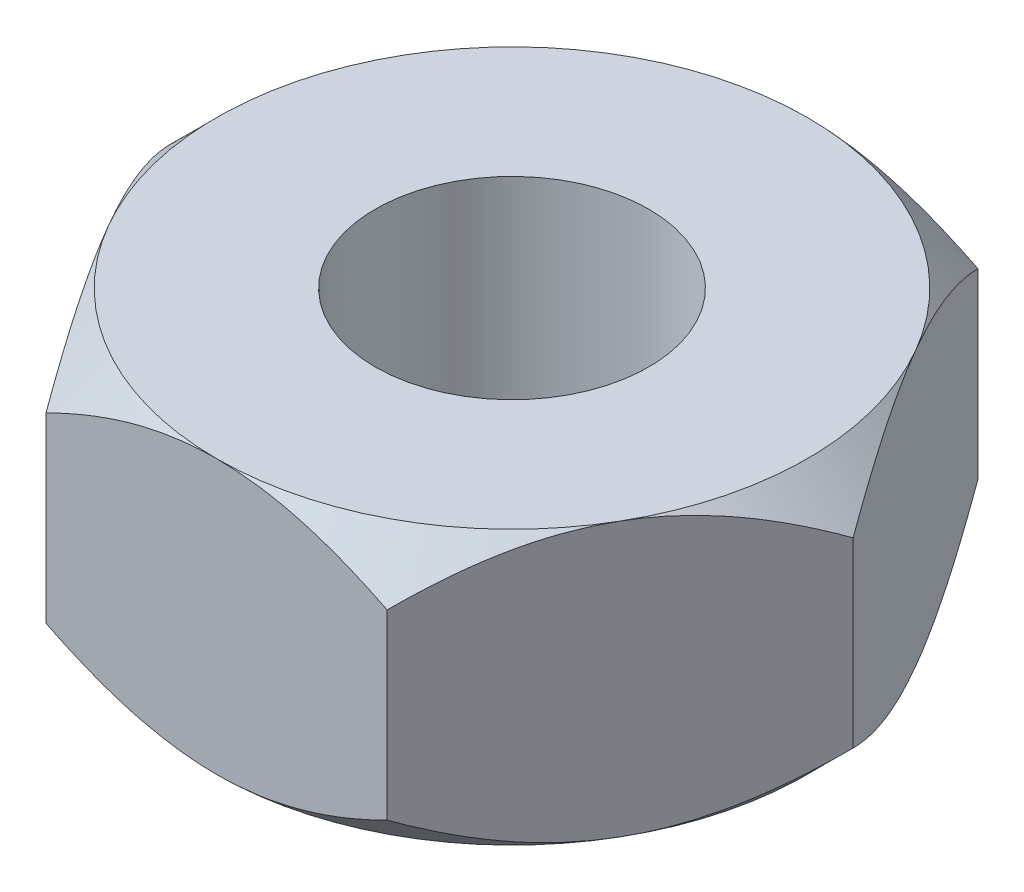
ISO-10303-21;
HEADER;
FILE_DESCRIPTION(('STEP AP214'),'2;1');
FILE_NAME('part.step','',(''),(''),'','','');
FILE_SCHEMA(('AUTOMOTIVE_DESIGN { 1 0 10303 214 1 1 1 1 }'));
ENDSEC;
DATA;
#1=APPLICATION_CONTEXT('core data for automotive mechanical design processes');
#2=APPLICATION_PROTOCOL_DEFINITION('international standard','automotive_design',2000,#1);
#3=PRODUCT_CONTEXT('',#1,'mechanical');
#4=PRODUCT('Part','Part','',(#3));
#5=PRODUCT_RELATED_PRODUCT_CATEGORY('part','',(#4));
#6=PRODUCT_DEFINITION_FORMATION('','',#4);
#7=PRODUCT_DEFINITION_CONTEXT('part definition',#1,'design');
#8=PRODUCT_DEFINITION('design','',#6,#7);
#9=PRODUCT_DEFINITION_SHAPE('','',#8);
#10=(LENGTH_UNIT() NAMED_UNIT(*) SI_UNIT(.MILLI.,.METRE.));
#11=(NAMED_UNIT(*) PLANE_ANGLE_UNIT() SI_UNIT($,.RADIAN.));
#12=(NAMED_UNIT(*) SI_UNIT($,.STERADIAN.) SOLID_ANGLE_UNIT());
#13=UNCERTAINTY_MEASURE_WITH_UNIT(LENGTH_MEASURE(1.E-05),#10,'distance_accuracy_value','');
#14=(GEOMETRIC_REPRESENTATION_CONTEXT(3) GLOBAL_UNCERTAINTY_ASSIGNED_CONTEXT((#13)) GLOBAL_UNIT_ASSIGNED_CONTEXT((#10,
#11,#12)) REPRESENTATION_CONTEXT('',''));
#15=CARTESIAN_POINT('',(0.,0.,0.));
#16=DIRECTION('',(0.,0.,1.));
#17=DIRECTION('',(1.,0.,0.));
#18=AXIS2_PLACEMENT_3D('',#15,#16,#17);
#19=CARTESIAN_POINT('',(0.,1.25,0.));
#20=DIRECTION('',(0.,1.,0.));
#21=DIRECTION('',(0.,0.,1.));
#22=AXIS2_PLACEMENT_3D('',#19,#20,#21);
#23=PLANE('',#22);
#24=CARTESIAN_POINT('',(0.,1.25,0.));
#25=DIRECTION('',(0.,1.,0.));
#26=DIRECTION('',(0.,0.,1.));
#27=AXIS2_PLACEMENT_3D('',#24,#25,#26);
#28=CIRCLE('',#27,1.24999999999999);
#29=CARTESIAN_POINT('',(0.,1.25,1.24999999999999));
#30=VERTEX_POINT('',#29);
#31=EDGE_CURVE('E305',#30,#30,#28,.T.);
#32=ORIENTED_EDGE('',*,*,#31,.F.);
#33=EDGE_LOOP('',(#32));
#34=FACE_BOUND('',#33,.T.);
#35=CARTESIAN_POINT('',(0.,1.25,0.));
#36=DIRECTION('',(0.,1.,0.));
#37=DIRECTION('',(0.,0.,1.));
#38=AXIS2_PLACEMENT_3D('',#35,#36,#37);
#39=CIRCLE('',#38,2.70000000000002);
#40=CARTESIAN_POINT('',(0.,1.25,2.70000000000002));
#41=VERTEX_POINT('',#40);
#42=CARTESIAN_POINT('',(-2.338268590218,1.25,1.35000000000001));
#43=VERTEX_POINT('',#42);
#44=EDGE_CURVE('E12',#41,#43,#39,.F.);
#45=ORIENTED_EDGE('',*,*,#44,.F.);
#46=CARTESIAN_POINT('',(2.338268590218,1.25,1.35000000000001));
#47=VERTEX_POINT('',#46);
#48=EDGE_CURVE('E48',#47,#41,#39,.F.);
#49=ORIENTED_EDGE('',*,*,#48,.F.);
#50=CARTESIAN_POINT('',(2.338268590218,1.25,-1.35000000000001));
#51=VERTEX_POINT('',#50);
#52=EDGE_CURVE('E158',#51,#47,#39,.F.);
#53=ORIENTED_EDGE('',*,*,#52,.F.);
#54=CARTESIAN_POINT('',(0.,1.25,0.));
#55=DIRECTION('',(0.,-1.,0.));
#56=DIRECTION('',(0.,0.,-1.));
#57=AXIS2_PLACEMENT_3D('',#54,#55,#56);
#58=CIRCLE('',#57,2.70000000000002);
#59=CARTESIAN_POINT('',(0.,1.25,-2.70000000000002));
#60=VERTEX_POINT('',#59);
#61=EDGE_CURVE('E146',#60,#51,#58,.T.);
#62=ORIENTED_EDGE('',*,*,#61,.F.);
#63=CARTESIAN_POINT('',(-2.338268590218,1.25,-1.35000000000001));
#64=VERTEX_POINT('',#63);
#65=EDGE_CURVE('E420',#64,#60,#39,.F.);
#66=ORIENTED_EDGE('',*,*,#65,.F.);
#67=EDGE_CURVE('E54',#43,#64,#39,.F.);
#68=ORIENTED_EDGE('',*,*,#67,.F.);
#69=EDGE_LOOP('',(#45,#49,#53,#62,#66,#68));
#70=FACE_BOUND('',#69,.T.);
#71=ADVANCED_FACE('F43',(#34,#70),#23,.T.);
#72=CARTESIAN_POINT('',(1.55884572681198,1.25,2.70000000000001));
#73=DIRECTION('',(-0.866025403784438,0.,-0.500000000000001));
#74=DIRECTION('',(-0.500000000000001,0.,0.866025403784438));
#75=AXIS2_PLACEMENT_3D('',#72,#73,#74);
#76=PLANE('',#75);
#77=DIRECTION('',(0.,-1.,0.));
#78=VECTOR('',#77,1.);
#79=CARTESIAN_POINT('',(3.11769145362398,1.25,0.));
#80=LINE('',#79,#78);
#81=CARTESIAN_POINT('',(3.11769145362398,0.832308546376041,0.));
#82=VERTEX_POINT('',#81);
#83=CARTESIAN_POINT('',(3.11769145362398,-0.832308546376041,0.));
#84=VERTEX_POINT('',#83);
#85=EDGE_CURVE('E329',#82,#84,#80,.T.);
#86=ORIENTED_EDGE('',*,*,#85,.F.);
#87=CARTESIAN_POINT('',(3.11780692367782,0.832193069907437,-0.000199999999996531));
#88=CARTESIAN_POINT('',(3.06422167379383,0.885732794827783,0.0926123753353544));
#89=CARTESIAN_POINT('',(3.009740407035,0.93612806527719,0.186976697422359));
#90=CARTESIAN_POINT('',(2.89864710495835,1.02840062434018,0.379395940999699));
#91=CARTESIAN_POINT('',(2.84202450431693,1.07022657249699,0.477469162167336));
#92=CARTESIAN_POINT('',(2.72784773232675,1.14187524757681,0.675229132298521));
#93=CARTESIAN_POINT('',(2.67032263900893,1.17187806135873,0.774865516635131));
#94=CARTESIAN_POINT('',(2.5540060491414,1.21810362683617,0.976331760048835));
#95=CARTESIAN_POINT('',(2.49521810592332,1.23436088475358,1.07815546457503));
#96=CARTESIAN_POINT('',(2.3939001211297,1.24902914006629,1.25364336195808));
#97=CARTESIAN_POINT('',(2.35150097221465,1.25120050888209,1.32708084207662));
#98=CARTESIAN_POINT('',(2.26677198310487,1.24754233330539,1.47383575608871));
#99=CARTESIAN_POINT('',(2.22444217241577,1.24170998398709,1.54715313887699));
#100=CARTESIAN_POINT('',(2.14018224558464,1.22237626945354,1.69309561319055));
#101=CARTESIAN_POINT('',(2.09825262999166,1.2088663254669,1.76571983773943));
#102=CARTESIAN_POINT('',(2.01511846407659,1.17491901553749,1.90971243694919));
#103=CARTESIAN_POINT('',(1.97391385842353,1.15448218067128,1.98108090744612));
#104=CARTESIAN_POINT('',(1.86837302526163,1.09381204154214,2.16388299275569));
#105=CARTESIAN_POINT('',(1.80469114916652,1.04900591768386,2.27418323767372));
#106=CARTESIAN_POINT('',(1.71105248224891,0.973367210017474,2.43637016632804));
#107=CARTESIAN_POINT('',(1.68019435228959,0.946791274382121,2.48981801524414));
#108=CARTESIAN_POINT('',(1.61904967325436,0.89121683212296,2.59572370594566));
#109=CARTESIAN_POINT('',(1.58876278712705,0.862219812555685,2.64818213152121));
#110=CARTESIAN_POINT('',(1.55873025675814,0.832193069907433,2.70020000000001));
#111=B_SPLINE_CURVE_WITH_KNOTS('',3,(#87,#88,#89,#90,#91,#92,#93,#94,#95,#96,#97,#98,#99,#100,
#101,#102,#103,#104,#105,#106,#107,#108,#109,#110),.UNSPECIFIED.,.F.,.F.,(4,2,2,2,2,2,2,2,2,2,2,
4),(0.,0.359648673878966,0.721392825422786,1.07739169570524,1.43249420646205,1.68661231167063,
1.94081949603894,2.19531128585872,2.44978356850446,2.85398095255913,3.05553160695458,
3.2569593647654),.UNSPECIFIED.);
#112=EDGE_CURVE('E414',#82,#47,#111,.T.);
#113=ORIENTED_EDGE('',*,*,#112,.T.);
#114=CARTESIAN_POINT('',(1.55884572681198,0.832308546376036,2.70000000000001));
#115=VERTEX_POINT('',#114);
#116=EDGE_CURVE('E153',#47,#115,#111,.T.);
#117=ORIENTED_EDGE('',*,*,#116,.T.);
#118=DIRECTION('',(0.,-1.,0.));
#119=VECTOR('',#118,1.);
#120=CARTESIAN_POINT('',(1.55884572681198,1.25,2.70000000000001));
#121=LINE('',#120,#119);
#122=CARTESIAN_POINT('',(1.55884572681198,-0.832308546376036,2.70000000000001));
#123=VERTEX_POINT('',#122);
#124=EDGE_CURVE('E164',#115,#123,#121,.T.);
#125=ORIENTED_EDGE('',*,*,#124,.T.);
#126=CARTESIAN_POINT('',(3.11780692367782,-0.832193069907437,-0.000199999999996531));
#127=CARTESIAN_POINT('',(3.06422167379383,-0.885732794827783,0.0926123753353544));
#128=CARTESIAN_POINT('',(3.009740407035,-0.93612806527719,0.186976697422359));
#129=CARTESIAN_POINT('',(2.89864710495835,-1.02840062434018,0.379395940999699));
#130=CARTESIAN_POINT('',(2.84202450431693,-1.07022657249699,0.477469162167336));
#131=CARTESIAN_POINT('',(2.72784773232675,-1.14187524757681,0.675229132298521));
#132=CARTESIAN_POINT('',(2.67032263900893,-1.17187806135873,0.774865516635131));
#133=CARTESIAN_POINT('',(2.5540060491414,-1.21810362683617,0.976331760048835));
#134=CARTESIAN_POINT('',(2.49521810592332,-1.23436088475358,1.07815546457503));
#135=CARTESIAN_POINT('',(2.3939001211297,-1.24902914006629,1.25364336195808));
#136=CARTESIAN_POINT('',(2.35150097221465,-1.25120050888209,1.32708084207662));
#137=CARTESIAN_POINT('',(2.26677198310487,-1.24754233330539,1.47383575608871));
#138=CARTESIAN_POINT('',(2.22444217241577,-1.24170998398709,1.54715313887699));
#139=CARTESIAN_POINT('',(2.14018224558464,-1.22237626945354,1.69309561319055));
#140=CARTESIAN_POINT('',(2.09825262999166,-1.2088663254669,1.76571983773943));
#141=CARTESIAN_POINT('',(2.01511846407659,-1.17491901553749,1.90971243694919));
#142=CARTESIAN_POINT('',(1.97391385842353,-1.15448218067128,1.98108090744612));
#143=CARTESIAN_POINT('',(1.86837302526163,-1.09381204154214,2.16388299275569));
#144=CARTESIAN_POINT('',(1.80469114916652,-1.04900591768386,2.27418323767372));
#145=CARTESIAN_POINT('',(1.71105248224891,-0.973367210017474,2.43637016632804));
#146=CARTESIAN_POINT('',(1.68019435228959,-0.946791274382121,2.48981801524414));
#147=CARTESIAN_POINT('',(1.61904967325436,-0.89121683212296,2.59572370594566));
#148=CARTESIAN_POINT('',(1.58876278712705,-0.862219812555685,2.64818213152121));
#149=CARTESIAN_POINT('',(1.55873025675814,-0.832193069907433,2.70020000000001));
#150=B_SPLINE_CURVE_WITH_KNOTS('',3,(#126,#127,#128,#129,#130,#131,#132,#133,#134,#135,#136,
#137,#138,#139,#140,#141,#142,#143,#144,#145,#146,#147,#148,#149),.UNSPECIFIED.,.F.,.F.,(4,2,2,
2,2,2,2,2,2,2,2,4),(0.,0.359648673878966,0.721392825422786,1.07739169570524,1.43249420646205,
1.68661231167063,1.94081949603894,2.19531128585872,2.44978356850446,2.85398095255913,
3.05553160695458,3.2569593647654),.UNSPECIFIED.);
#151=CARTESIAN_POINT('',(2.338268590218,-1.25,1.35000000000001));
#152=VERTEX_POINT('',#151);
#153=EDGE_CURVE('E235',#152,#123,#150,.T.);
#154=ORIENTED_EDGE('',*,*,#153,.F.);
#155=EDGE_CURVE('E379',#84,#152,#150,.T.);
#156=ORIENTED_EDGE('',*,*,#155,.F.);
#157=EDGE_LOOP('',(#86,#113,#117,#125,#154,#156));
#158=FACE_BOUND('',#157,.T.);
#159=ADVANCED_FACE('F45',(#158),#76,.F.);
#160=CARTESIAN_POINT('',(3.11769145362398,1.25,0.));
#161=DIRECTION('',(-0.866025403784438,0.,0.5));
#162=DIRECTION('',(0.5,0.,0.866025403784438));
#163=AXIS2_PLACEMENT_3D('',#160,#161,#162);
#164=PLANE('',#163);
#165=DIRECTION('',(0.,-1.,0.));
#166=VECTOR('',#165,1.);
#167=CARTESIAN_POINT('',(1.55884572681197,1.25,-2.70000000000002));
#168=LINE('',#167,#166);
#169=CARTESIAN_POINT('',(1.55884572681197,0.832308546376031,-2.70000000000002));
#170=VERTEX_POINT('',#169);
#171=CARTESIAN_POINT('',(1.55884572681197,-0.832308546376031,-2.70000000000002));
#172=VERTEX_POINT('',#171);
#173=EDGE_CURVE('E326',#170,#172,#168,.T.);
#174=ORIENTED_EDGE('',*,*,#173,.F.);
#175=CARTESIAN_POINT('',(1.55873025675814,0.832193069907427,-2.70020000000002));
#176=CARTESIAN_POINT('',(1.61231550664213,0.885732794827773,-2.60738762466467));
#177=CARTESIAN_POINT('',(1.66679677340096,0.936128065277182,-2.51302330257766));
#178=CARTESIAN_POINT('',(1.7778900754776,1.02840062434017,-2.32060405900032));
#179=CARTESIAN_POINT('',(1.83451267611903,1.07022657249699,-2.22253083783268));
#180=CARTESIAN_POINT('',(1.94868944810921,1.14187524757681,-2.0247708677015));
#181=CARTESIAN_POINT('',(2.00621454142703,1.17187806135873,-1.92513448336488));
#182=CARTESIAN_POINT('',(2.12253113129456,1.21810362683617,-1.72366823995118));
#183=CARTESIAN_POINT('',(2.18131907451264,1.23436088475358,-1.62184453542498));
#184=CARTESIAN_POINT('',(2.28263705930627,1.2490291400663,-1.44635663804193));
#185=CARTESIAN_POINT('',(2.32503620822131,1.2512005088821,-1.37291915792339));
#186=CARTESIAN_POINT('',(2.4097651973311,1.24754233330539,-1.2261642439113));
#187=CARTESIAN_POINT('',(2.45209500802019,1.24170998398709,-1.15284686112302));
#188=CARTESIAN_POINT('',(2.53635493485132,1.22237626945354,-1.00690438680946));
#189=CARTESIAN_POINT('',(2.57828455044431,1.2088663254669,-0.934280162260579));
#190=CARTESIAN_POINT('',(2.66141871635937,1.17491901553749,-0.790287563050821));
#191=CARTESIAN_POINT('',(2.70262332201243,1.15448218067128,-0.718919092553885));
#192=CARTESIAN_POINT('',(2.80816415517433,1.09381204154214,-0.53611700724432));
#193=CARTESIAN_POINT('',(2.87184603126944,1.04900591768386,-0.425816762326288));
#194=CARTESIAN_POINT('',(2.96548469818705,0.973367210017478,-0.263629833671965));
#195=CARTESIAN_POINT('',(2.99634282814637,0.946791274382125,-0.210181984755868));
#196=CARTESIAN_POINT('',(3.05748750718161,0.891216832122965,-0.104276294054347));
#197=CARTESIAN_POINT('',(3.08777439330891,0.862219812555689,-0.051817868478796));
#198=CARTESIAN_POINT('',(3.11780692367782,0.832193069907437,0.000200000000003596));
#199=B_SPLINE_CURVE_WITH_KNOTS('',3,(#175,#176,#177,#178,#179,#180,#181,#182,#183,#184,#185,
#186,#187,#188,#189,#190,#191,#192,#193,#194,#195,#196,#197,#198),.UNSPECIFIED.,.F.,.F.,(4,2,2,
2,2,2,2,2,2,2,2,4),(0.,0.359648673878971,0.721392825422796,1.07739169570526,1.43249420646208,
1.68661231167066,1.94081949603896,2.19531128585874,2.44978356850448,2.85398095255915,
3.0555316069546,3.25695936476543),.UNSPECIFIED.);
#200=EDGE_CURVE('E281',#170,#51,#199,.T.);
#201=ORIENTED_EDGE('',*,*,#200,.T.);
#202=EDGE_CURVE('E270',#51,#82,#199,.T.);
#203=ORIENTED_EDGE('',*,*,#202,.T.);
#204=ORIENTED_EDGE('',*,*,#85,.T.);
#205=CARTESIAN_POINT('',(1.55873025675814,-0.832193069907427,-2.70020000000002));
#206=CARTESIAN_POINT('',(1.61231550664213,-0.885732794827774,-2.60738762466467));
#207=CARTESIAN_POINT('',(1.66679677340096,-0.936128065277183,-2.51302330257766));
#208=CARTESIAN_POINT('',(1.7778900754776,-1.02840062434017,-2.32060405900032));
#209=CARTESIAN_POINT('',(1.83451267611903,-1.07022657249699,-2.22253083783268));
#210=CARTESIAN_POINT('',(1.94868944810921,-1.14187524757681,-2.0247708677015));
#211=CARTESIAN_POINT('',(2.00621454142703,-1.17187806135873,-1.92513448336488));
#212=CARTESIAN_POINT('',(2.12253113129456,-1.21810362683617,-1.72366823995118));
#213=CARTESIAN_POINT('',(2.18131907451264,-1.23436088475358,-1.62184453542498));
#214=CARTESIAN_POINT('',(2.28263705930627,-1.2490291400663,-1.44635663804193));
#215=CARTESIAN_POINT('',(2.32503620822131,-1.2512005088821,-1.37291915792339));
#216=CARTESIAN_POINT('',(2.4097651973311,-1.24754233330539,-1.2261642439113));
#217=CARTESIAN_POINT('',(2.45209500802019,-1.24170998398709,-1.15284686112302));
#218=CARTESIAN_POINT('',(2.53635493485132,-1.22237626945354,-1.00690438680946));
#219=CARTESIAN_POINT('',(2.57828455044431,-1.2088663254669,-0.934280162260579));
#220=CARTESIAN_POINT('',(2.66141871635937,-1.17491901553749,-0.790287563050821));
#221=CARTESIAN_POINT('',(2.70262332201243,-1.15448218067128,-0.718919092553886));
#222=CARTESIAN_POINT('',(2.80816415517433,-1.09381204154214,-0.536117007244321));
#223=CARTESIAN_POINT('',(2.87184603126944,-1.04900591768386,-0.425816762326289));
#224=CARTESIAN_POINT('',(2.96548469818705,-0.973367210017478,-0.263629833671965));
#225=CARTESIAN_POINT('',(2.99634282814637,-0.946791274382125,-0.210181984755869));
#226=CARTESIAN_POINT('',(3.05748750718161,-0.891216832122964,-0.104276294054347));
#227=CARTESIAN_POINT('',(3.08777439330891,-0.862219812555689,-0.0518178684787963));
#228=CARTESIAN_POINT('',(3.11780692367782,-0.832193069907437,0.000200000000003362));
#229=B_SPLINE_CURVE_WITH_KNOTS('',3,(#205,#206,#207,#208,#209,#210,#211,#212,#213,#214,#215,
#216,#217,#218,#219,#220,#221,#222,#223,#224,#225,#226,#227,#228),.UNSPECIFIED.,.F.,.F.,(4,2,2,
2,2,2,2,2,2,2,2,4),(0.,0.359648673878971,0.721392825422796,1.07739169570526,1.43249420646208,
1.68661231167066,1.94081949603896,2.19531128585874,2.44978356850448,2.85398095255915,
3.0555316069546,3.25695936476543),.UNSPECIFIED.);
#230=CARTESIAN_POINT('',(2.338268590218,-1.25,-1.35000000000001));
#231=VERTEX_POINT('',#230);
#232=EDGE_CURVE('E247',#231,#84,#229,.T.);
#233=ORIENTED_EDGE('',*,*,#232,.F.);
#234=EDGE_CURVE('E369',#172,#231,#229,.T.);
#235=ORIENTED_EDGE('',*,*,#234,.F.);
#236=EDGE_LOOP('',(#174,#201,#203,#204,#233,#235));
#237=FACE_BOUND('',#236,.T.);
#238=ADVANCED_FACE('F287',(#237),#164,.F.);
#239=CARTESIAN_POINT('',(1.55884572681197,1.25,-2.70000000000002));
#240=DIRECTION('',(0.,0.,1.));
#241=DIRECTION('',(1.,0.,0.));
#242=AXIS2_PLACEMENT_3D('',#239,#240,#241);
#243=PLANE('',#242);
#244=DIRECTION('',(0.,-1.,0.));
#245=VECTOR('',#244,1.);
#246=CARTESIAN_POINT('',(-1.558845726812,1.25,-2.70000000000002));
#247=LINE('',#246,#245);
#248=CARTESIAN_POINT('',(-1.558845726812,0.83230854637602,-2.70000000000002));
#249=VERTEX_POINT('',#248);
#250=CARTESIAN_POINT('',(-1.558845726812,-0.83230854637602,-2.70000000000002));
#251=VERTEX_POINT('',#250);
#252=EDGE_CURVE('E323',#249,#251,#247,.T.);
#253=ORIENTED_EDGE('',*,*,#252,.F.);
#254=CARTESIAN_POINT('',(-3.33748174051035,-0.342876001964175,-2.70000000000002));
#255=CARTESIAN_POINT('',(-3.25716404319239,-0.280447185801499,-2.70000000000002));
#256=CARTESIAN_POINT('',(-3.17642329933076,-0.21855425881172,-2.70000000000002));
#257=CARTESIAN_POINT('',(-3.01391943660475,-0.0960877399459706,-2.70000000000002));
#258=CARTESIAN_POINT('',(-2.93215608813524,-0.0355144530542119,-2.70000000000002));
#259=CARTESIAN_POINT('',(-2.76683457296794,0.0844957634864989,-2.70000000000002));
#260=CARTESIAN_POINT('',(-2.68326744236738,0.14392038433726,-2.70000000000002));
#261=CARTESIAN_POINT('',(-2.51475955183379,0.260782114444306,-2.70000000000002));
#262=CARTESIAN_POINT('',(-2.42981888589315,0.318219358861263,-2.70000000000002));
#263=CARTESIAN_POINT('',(-2.25257069638597,0.43442078733459,-2.70000000000002));
#264=CARTESIAN_POINT('',(-2.16015137040786,0.493015282720766,-2.70000000000002));
#265=CARTESIAN_POINT('',(-1.97313779320441,0.606684774713602,-2.70000000000002));
#266=CARTESIAN_POINT('',(-1.87854316766993,0.661759159350215,-2.70000000000002));
#267=CARTESIAN_POINT('',(-1.68713341892302,0.767224732634677,-2.70000000000002));
#268=CARTESIAN_POINT('',(-1.59032591315742,0.817629638222112,-2.70000000000002));
#269=CARTESIAN_POINT('',(-1.39392212634757,0.912626740112958,-2.70000000000002));
#270=CARTESIAN_POINT('',(-1.29432721819625,0.957221738855746,-2.70000000000002));
#271=CARTESIAN_POINT('',(-1.10304595625342,1.03453857091251,-2.70000000000002));
#272=CARTESIAN_POINT('',(-1.01167106732204,1.06802318961189,-2.70000000000002));
#273=CARTESIAN_POINT('',(-0.826521180360102,1.12768450263268,-2.70000000000002));
#274=CARTESIAN_POINT('',(-0.732746035838527,1.15386074974726,-2.70000000000002));
#275=CARTESIAN_POINT('',(-0.545033435692663,1.19702070751438,-2.70000000000002));
#276=CARTESIAN_POINT('',(-0.451136350624625,1.21417699336086,-2.70000000000002));
#277=CARTESIAN_POINT('',(-0.262083105011648,1.23892646040094,-2.70000000000002));
#278=CARTESIAN_POINT('',(-0.166927239770874,1.24652184570124,-2.70000000000002));
#279=CARTESIAN_POINT('',(0.0190355539733061,1.25145529621592,-2.70000000000002));
#280=CARTESIAN_POINT('',(0.109829811952344,1.24927251361133,-2.70000000000002));
#281=CARTESIAN_POINT('',(0.290746085738264,1.23589036519909,-2.70000000000002));
#282=CARTESIAN_POINT('',(0.380868042566657,1.22469021750492,-2.70000000000002));
#283=CARTESIAN_POINT('',(0.561321422413492,1.19372990406524,-2.70000000000002));
#284=CARTESIAN_POINT('',(0.651625936109748,1.17381536718046,-2.70000000000002));
#285=CARTESIAN_POINT('',(0.830222211801441,1.12655304417434,-2.70000000000002));
#286=CARTESIAN_POINT('',(0.918514054976468,1.09920555843257,-2.70000000000002));
#287=CARTESIAN_POINT('',(1.18703861404306,1.00549564396809,-2.70000000000002));
#288=CARTESIAN_POINT('',(1.36369999085405,0.928871617649592,-2.70000000000002));
#289=CARTESIAN_POINT('',(1.62227066876333,0.801007114189322,-2.70000000000002));
#290=CARTESIAN_POINT('',(1.70754761502435,0.756132558495489,-2.70000000000002));
#291=CARTESIAN_POINT('',(1.87617453082753,0.662890322262534,-2.70000000000002));
#292=CARTESIAN_POINT('',(1.95952483210979,0.614523249088225,-2.70000000000002));
#293=CARTESIAN_POINT('',(2.12045638256463,0.51744632030112,-2.70000000000002));
#294=CARTESIAN_POINT('',(2.19811954884283,0.4688707421871,-2.70000000000002));
#295=CARTESIAN_POINT('',(2.3521129860895,0.369641020806029,-2.70000000000002));
#296=CARTESIAN_POINT('',(2.42844315708374,0.318986722581902,-2.70000000000002));
#297=CARTESIAN_POINT('',(2.57933197938028,0.216380787488853,-2.70000000000002));
#298=CARTESIAN_POINT('',(2.65389990922258,0.164442738775613,-2.70000000000002));
#299=CARTESIAN_POINT('',(2.80201134511723,0.0591669900715878,-2.70000000000002));
#300=CARTESIAN_POINT('',(2.87555512799863,0.00582968000451422,-2.70000000000002));
#301=CARTESIAN_POINT('',(2.94866920599598,-0.0480808003827153,-2.70000000000002));
#302=B_SPLINE_CURVE_WITH_KNOTS('',3,(#254,#255,#256,#257,#258,#259,#260,#261,#262,#263,#264,
#265,#266,#267,#268,#269,#270,#271,#272,#273,#274,#275,#276,#277,#278,#279,#280,#281,#282,#283,
#284,#285,#286,#287,#288,#289,#290,#291,#292,#293,#294,#295,#296,#297,#298,#299,#300,#301),
.UNSPECIFIED.,.F.,.F.,(4,2,2,2,2,2,2,2,2,2,2,2,2,2,2,2,2,2,2,2,2,2,2,4),(0.,0.305184984915651,
0.610439769043978,0.918040211956588,1.2256196938027,1.55384355634399,1.8821243261496,
2.20940795289935,2.5365331235126,2.82823486236797,3.11995444684526,3.40586846177389,
3.69171655190002,3.96371486826368,4.23573677186391,4.51278587307895,4.78982377987845,
5.36573656683407,5.65480110141372,5.94381548685344,6.21859149430798,6.49338802213304,
6.76599040703726,7.03851761790156),.UNSPECIFIED.);
#303=EDGE_CURVE('E405',#249,#60,#302,.T.);
#304=ORIENTED_EDGE('',*,*,#303,.T.);
#305=EDGE_CURVE('E282',#60,#170,#302,.T.);
#306=ORIENTED_EDGE('',*,*,#305,.T.);
#307=ORIENTED_EDGE('',*,*,#173,.T.);
#308=CARTESIAN_POINT('',(-3.58509712419733,0.538086606776635,-2.70000000000002));
#309=CARTESIAN_POINT('',(-3.49960717022699,0.469811741452365,-2.70000000000002));
#310=CARTESIAN_POINT('',(-3.41369635867371,0.402056206880647,-2.70000000000002));
#311=CARTESIAN_POINT('',(-3.24084841262474,0.267830962268931,-2.70000000000002));
#312=CARTESIAN_POINT('',(-3.15391106851929,0.201361522414737,-2.70000000000002));
#313=CARTESIAN_POINT('',(-2.97819945067578,0.0694878418027467,-2.70000000000002));
#314=CARTESIAN_POINT('',(-2.88941626027192,0.00409544602730556,-2.70000000000002));
#315=CARTESIAN_POINT('',(-2.71044737875068,-0.12473346866105,-2.70000000000002));
#316=CARTESIAN_POINT('',(-2.62026178111586,-0.188170117107785,-2.70000000000002));
#317=CARTESIAN_POINT('',(-2.4310998063614,-0.317492446146356,-2.70000000000002));
#318=CARTESIAN_POINT('',(-2.3319880024342,-0.383181000396882,-2.70000000000002));
#319=CARTESIAN_POINT('',(-2.13142934239771,-0.510957568460279,-2.70000000000002));
#320=CARTESIAN_POINT('',(-2.02998204876974,-0.573044899843935,-2.70000000000002));
#321=CARTESIAN_POINT('',(-1.82464436995469,-0.692337946030165,-2.70000000000002));
#322=CARTESIAN_POINT('',(-1.7207622657533,-0.749557804021286,-2.70000000000002));
#323=CARTESIAN_POINT('',(-1.50985909297001,-0.857834281983638,-2.70000000000002));
#324=CARTESIAN_POINT('',(-1.40283965977502,-0.908894044423493,-2.70000000000002));
#325=CARTESIAN_POINT('',(-1.19973116024261,-0.996675027365138,-2.70000000000002));
#326=CARTESIAN_POINT('',(-1.1040803047209,-1.03440002938025,-2.70000000000002));
#327=CARTESIAN_POINT('',(-0.91005431066855,-1.10220355543207,-2.70000000000002));
#328=CARTESIAN_POINT('',(-0.811679018352105,-1.13228164684541,-2.70000000000002));
#329=CARTESIAN_POINT('',(-0.614697333529323,-1.18251071052421,-2.70000000000002));
#330=CARTESIAN_POINT('',(-0.516144104629453,-1.2028663982331,-2.70000000000002));
#331=CARTESIAN_POINT('',(-0.31744150267943,-1.23317304624031,-2.70000000000002));
#332=CARTESIAN_POINT('',(-0.217292632782803,-1.24312722301115,-2.70000000000002));
#333=CARTESIAN_POINT('',(-0.022933518359493,-1.25153579467721,-2.70000000000002));
#334=CARTESIAN_POINT('',(0.0712465719863812,-1.2506854277267,-2.70000000000002));
#335=CARTESIAN_POINT('',(0.259005791842863,-1.23922523630209,-2.70000000000002));
#336=CARTESIAN_POINT('',(0.352584876504734,-1.22861469182465,-2.70000000000002));
#337=CARTESIAN_POINT('',(0.540075104050012,-1.1981012715411,-2.70000000000002));
#338=CARTESIAN_POINT('',(0.633956723649171,-1.17802012342018,-2.70000000000002));
#339=CARTESIAN_POINT('',(0.819572663721889,-1.12977568910656,-2.70000000000002));
#340=CARTESIAN_POINT('',(0.911306961816251,-1.10161231872218,-2.70000000000002));
#341=CARTESIAN_POINT('',(1.18241110944899,-1.00732075004905,-2.70000000000002));
#342=CARTESIAN_POINT('',(1.35833328490644,-0.931266841792509,-2.70000000000002));
#343=CARTESIAN_POINT('',(1.61583762636069,-0.804310756881174,-2.70000000000002));
#344=CARTESIAN_POINT('',(1.70076215741918,-0.759750669436637,-2.70000000000002));
#345=CARTESIAN_POINT('',(1.86869580120694,-0.667148827727659,-2.70000000000002));
#346=CARTESIAN_POINT('',(1.95170523653626,-0.61910766558388,-2.70000000000002));
#347=CARTESIAN_POINT('',(2.1119642434957,-0.522682599707022,-2.70000000000002));
#348=CARTESIAN_POINT('',(2.18929563420652,-0.474433167533205,-2.70000000000002));
#349=CARTESIAN_POINT('',(2.34263139233396,-0.375860273089756,-2.70000000000002));
#350=CARTESIAN_POINT('',(2.41863566179854,-0.32553665864257,-2.70000000000002));
#351=CARTESIAN_POINT('',(2.56888628110114,-0.223587541245852,-2.70000000000002));
#352=CARTESIAN_POINT('',(2.64314177293013,-0.171975455832599,-2.70000000000002));
#353=CARTESIAN_POINT('',(2.79063143744675,-0.0673528189253612,-2.70000000000002));
#354=CARTESIAN_POINT('',(2.86386588531759,-0.0143426558196249,-2.70000000000002));
#355=CARTESIAN_POINT('',(2.9366715500098,0.0392405032332732,-2.70000000000002));
#356=B_SPLINE_CURVE_WITH_KNOTS('',3,(#308,#309,#310,#311,#312,#313,#314,#315,#316,#317,#318,
#319,#320,#321,#322,#323,#324,#325,#326,#327,#328,#329,#330,#331,#332,#333,#334,#335,#336,#337,
#338,#339,#340,#341,#342,#343,#344,#345,#346,#347,#348,#349,#350,#351,#352,#353,#354,#355),
.UNSPECIFIED.,.F.,.F.,(4,2,2,2,2,2,2,2,2,2,2,2,2,2,2,2,2,2,2,2,2,2,2,4),(0.,0.328227389324687,
0.656523000719024,0.987299434106761,1.31805391210863,1.67470480616875,2.03142306598986,
2.38706665105103,2.74252803645393,3.05073571034606,3.35896081718476,3.66037355581182,
3.96169306058543,4.24372739739963,4.52578254141251,4.81337291797895,5.10096629045389,
5.67418630302449,5.96187503614333,6.24951494860295,6.52292836776444,6.79636188241501,
7.06763632592626,7.3388361866636),.UNSPECIFIED.);
#357=CARTESIAN_POINT('',(0.,-1.25,-2.70000000000002));
#358=VERTEX_POINT('',#357);
#359=EDGE_CURVE('E224',#358,#172,#356,.T.);
#360=ORIENTED_EDGE('',*,*,#359,.F.);
#361=EDGE_CURVE('E309',#251,#358,#356,.T.);
#362=ORIENTED_EDGE('',*,*,#361,.F.);
#363=EDGE_LOOP('',(#253,#304,#306,#307,#360,#362));
#364=FACE_BOUND('',#363,.T.);
#365=ADVANCED_FACE('F257',(#364),#243,.F.);
#366=CARTESIAN_POINT('',(-1.558845726812,1.25,-2.70000000000002));
#367=DIRECTION('',(0.866025403784439,0.,0.499999999999999));
#368=DIRECTION('',(0.499999999999999,0.,-0.866025403784439));
#369=AXIS2_PLACEMENT_3D('',#366,#367,#368);
#370=PLANE('',#369);
#371=DIRECTION('',(0.,-1.,0.));
#372=VECTOR('',#371,1.);
#373=CARTESIAN_POINT('',(-3.117691453624,1.25,0.));
#374=LINE('',#373,#372);
#375=CARTESIAN_POINT('',(-3.117691453624,0.832308546376023,0.));
#376=VERTEX_POINT('',#375);
#377=CARTESIAN_POINT('',(-3.117691453624,-0.832308546376023,0.));
#378=VERTEX_POINT('',#377);
#379=EDGE_CURVE('E320',#376,#378,#374,.T.);
#380=ORIENTED_EDGE('',*,*,#379,.F.);
#381=CARTESIAN_POINT('',(-3.11780692367784,0.83219306990742,0.000200000000006939));
#382=CARTESIAN_POINT('',(-3.06422167379384,0.885732794827765,-0.0926123753353452));
#383=CARTESIAN_POINT('',(-3.00974040703501,0.936128065277173,-0.186976697422351));
#384=CARTESIAN_POINT('',(-2.89864710495837,1.02840062434016,-0.379395940999691));
#385=CARTESIAN_POINT('',(-2.84202450431694,1.07022657249698,-0.477469162167329));
#386=CARTESIAN_POINT('',(-2.72784773232677,1.1418752475768,-0.675229132298516));
#387=CARTESIAN_POINT('',(-2.67032263900895,1.17187806135871,-0.774865516635127));
#388=CARTESIAN_POINT('',(-2.55400604914142,1.21810362683615,-0.976331760048833));
#389=CARTESIAN_POINT('',(-2.49521810592334,1.23436088475357,-1.07815546457503));
#390=CARTESIAN_POINT('',(-2.39390012112971,1.24902914006628,-1.25364336195808));
#391=CARTESIAN_POINT('',(-2.35150097221467,1.25120050888208,-1.32708084207662));
#392=CARTESIAN_POINT('',(-2.26677198310488,1.24754233330538,-1.47383575608871));
#393=CARTESIAN_POINT('',(-2.22444217241579,1.24170998398707,-1.54715313887699));
#394=CARTESIAN_POINT('',(-2.14018224558466,1.22237626945352,-1.69309561319055));
#395=CARTESIAN_POINT('',(-2.09825262999167,1.20886632546689,-1.76571983773943));
#396=CARTESIAN_POINT('',(-2.0151184640766,1.17491901553747,-1.90971243694919));
#397=CARTESIAN_POINT('',(-1.97391385842355,1.15448218067127,-1.98108090744613));
#398=CARTESIAN_POINT('',(-1.86837302526164,1.09381204154212,-2.16388299275569));
#399=CARTESIAN_POINT('',(-1.80469114916654,1.04900591768384,-2.27418323767373));
#400=CARTESIAN_POINT('',(-1.71105248224892,0.973367210017459,-2.43637016632805));
#401=CARTESIAN_POINT('',(-1.68019435228961,0.946791274382106,-2.48981801524415));
#402=CARTESIAN_POINT('',(-1.61904967325437,0.891216832122945,-2.59572370594567));
#403=CARTESIAN_POINT('',(-1.58876278712706,0.862219812555669,-2.64818213152122));
#404=CARTESIAN_POINT('',(-1.55873025675816,0.832193069907417,-2.70020000000002));
#405=B_SPLINE_CURVE_WITH_KNOTS('',3,(#381,#382,#383,#384,#385,#386,#387,#388,#389,#390,#391,
#392,#393,#394,#395,#396,#397,#398,#399,#400,#401,#402,#403,#404),.UNSPECIFIED.,.F.,.F.,(4,2,2,
2,2,2,2,2,2,2,2,4),(0.,0.359648673878968,0.72139282542279,1.07739169570525,1.43249420646207,
1.68661231167065,1.94081949603895,2.19531128585873,2.44978356850448,2.85398095255915,
3.0555316069546,3.25695936476543),.UNSPECIFIED.);
#406=EDGE_CURVE('E262',#376,#64,#405,.T.);
#407=ORIENTED_EDGE('',*,*,#406,.T.);
#408=EDGE_CURVE('E68',#64,#249,#405,.T.);
#409=ORIENTED_EDGE('',*,*,#408,.T.);
#410=ORIENTED_EDGE('',*,*,#252,.T.);
#411=CARTESIAN_POINT('',(-3.11780692367784,-0.83219306990742,0.000200000000006939));
#412=CARTESIAN_POINT('',(-3.06422167379384,-0.885732794827765,-0.0926123753353452));
#413=CARTESIAN_POINT('',(-3.00974040703501,-0.936128065277173,-0.186976697422351));
#414=CARTESIAN_POINT('',(-2.89864710495837,-1.02840062434016,-0.379395940999691));
#415=CARTESIAN_POINT('',(-2.84202450431694,-1.07022657249698,-0.477469162167329));
#416=CARTESIAN_POINT('',(-2.72784773232677,-1.1418752475768,-0.675229132298516));
#417=CARTESIAN_POINT('',(-2.67032263900895,-1.17187806135871,-0.774865516635127));
#418=CARTESIAN_POINT('',(-2.55400604914142,-1.21810362683615,-0.976331760048833));
#419=CARTESIAN_POINT('',(-2.49521810592334,-1.23436088475357,-1.07815546457503));
#420=CARTESIAN_POINT('',(-2.39390012112971,-1.24902914006628,-1.25364336195808));
#421=CARTESIAN_POINT('',(-2.35150097221467,-1.25120050888208,-1.32708084207662));
#422=CARTESIAN_POINT('',(-2.26677198310488,-1.24754233330538,-1.47383575608871));
#423=CARTESIAN_POINT('',(-2.22444217241579,-1.24170998398707,-1.54715313887699));
#424=CARTESIAN_POINT('',(-2.14018224558466,-1.22237626945352,-1.69309561319055));
#425=CARTESIAN_POINT('',(-2.09825262999167,-1.20886632546689,-1.76571983773943));
#426=CARTESIAN_POINT('',(-2.0151184640766,-1.17491901553747,-1.90971243694919));
#427=CARTESIAN_POINT('',(-1.97391385842355,-1.15448218067127,-1.98108090744613));
#428=CARTESIAN_POINT('',(-1.86837302526164,-1.09381204154212,-2.16388299275569));
#429=CARTESIAN_POINT('',(-1.80469114916654,-1.04900591768384,-2.27418323767373));
#430=CARTESIAN_POINT('',(-1.71105248224892,-0.973367210017459,-2.43637016632805));
#431=CARTESIAN_POINT('',(-1.68019435228961,-0.946791274382106,-2.48981801524415));
#432=CARTESIAN_POINT('',(-1.61904967325437,-0.891216832122945,-2.59572370594567));
#433=CARTESIAN_POINT('',(-1.58876278712706,-0.862219812555669,-2.64818213152122));
#434=CARTESIAN_POINT('',(-1.55873025675816,-0.832193069907417,-2.70020000000002));
#435=B_SPLINE_CURVE_WITH_KNOTS('',3,(#411,#412,#413,#414,#415,#416,#417,#418,#419,#420,#421,
#422,#423,#424,#425,#426,#427,#428,#429,#430,#431,#432,#433,#434),.UNSPECIFIED.,.F.,.F.,(4,2,2,
2,2,2,2,2,2,2,2,4),(0.,0.359648673878968,0.72139282542279,1.07739169570525,1.43249420646207,
1.68661231167065,1.94081949603895,2.19531128585873,2.44978356850448,2.85398095255915,
3.0555316069546,3.25695936476543),.UNSPECIFIED.);
#436=CARTESIAN_POINT('',(-2.338268590218,-1.25,-1.35000000000001));
#437=VERTEX_POINT('',#436);
#438=EDGE_CURVE('E249',#437,#251,#435,.T.);
#439=ORIENTED_EDGE('',*,*,#438,.F.);
#440=EDGE_CURVE('E241',#378,#437,#435,.T.);
#441=ORIENTED_EDGE('',*,*,#440,.F.);
#442=EDGE_LOOP('',(#380,#407,#409,#410,#439,#441));
#443=FACE_BOUND('',#442,.T.);
#444=ADVANCED_FACE('F254',(#443),#370,.F.);
#445=CARTESIAN_POINT('',(-3.117691453624,1.25,0.));
#446=DIRECTION('',(0.866025403784438,0.,-0.5));
#447=DIRECTION('',(-0.5,0.,-0.866025403784438));
#448=AXIS2_PLACEMENT_3D('',#445,#446,#447);
#449=PLANE('',#448);
#450=DIRECTION('',(0.,-1.,0.));
#451=VECTOR('',#450,1.);
#452=CARTESIAN_POINT('',(-1.558845726812,1.25,2.70000000000001));
#453=LINE('',#452,#451);
#454=CARTESIAN_POINT('',(-1.558845726812,0.832308546376023,2.70000000000001));
#455=VERTEX_POINT('',#454);
#456=CARTESIAN_POINT('',(-1.558845726812,-0.832308546376023,2.70000000000001));
#457=VERTEX_POINT('',#456);
#458=EDGE_CURVE('E317',#455,#457,#453,.T.);
#459=ORIENTED_EDGE('',*,*,#458,.F.);
#460=CARTESIAN_POINT('',(-1.55873025675816,0.83219306990742,2.70020000000001));
#461=CARTESIAN_POINT('',(-1.61231550664216,0.885732794827765,2.60738762466466));
#462=CARTESIAN_POINT('',(-1.66679677340099,0.936128065277172,2.51302330257766));
#463=CARTESIAN_POINT('',(-1.77789007547763,1.02840062434016,2.32060405900032));
#464=CARTESIAN_POINT('',(-1.83451267611906,1.07022657249697,2.22253083783268));
#465=CARTESIAN_POINT('',(-1.94868944810923,1.14187524757679,2.0247708677015));
#466=CARTESIAN_POINT('',(-2.00621454142705,1.17187806135871,1.92513448336488));
#467=CARTESIAN_POINT('',(-2.12253113129458,1.21810362683615,1.72366823995118));
#468=CARTESIAN_POINT('',(-2.18131907451266,1.23436088475356,1.62184453542498));
#469=CARTESIAN_POINT('',(-2.28263705930629,1.24902914006628,1.44635663804193));
#470=CARTESIAN_POINT('',(-2.32503620822133,1.25120050888208,1.3729191579234));
#471=CARTESIAN_POINT('',(-2.40976519733112,1.24754233330537,1.2261642439113));
#472=CARTESIAN_POINT('',(-2.45209500802021,1.24170998398707,1.15284686112302));
#473=CARTESIAN_POINT('',(-2.53635493485134,1.22237626945352,1.00690438680947));
#474=CARTESIAN_POINT('',(-2.57828455044433,1.20886632546688,0.934280162260582));
#475=CARTESIAN_POINT('',(-2.6614187163594,1.17491901553747,0.790287563050822));
#476=CARTESIAN_POINT('',(-2.70262332201245,1.15448218067126,0.718919092553886));
#477=CARTESIAN_POINT('',(-2.80816415517436,1.09381204154212,0.536117007244323));
#478=CARTESIAN_POINT('',(-2.87184603126946,1.04900591768384,0.425816762326292));
#479=CARTESIAN_POINT('',(-2.96548469818707,0.973367210017458,0.263629833671972));
#480=CARTESIAN_POINT('',(-2.99634282814639,0.946791274382105,0.210181984755876));
#481=CARTESIAN_POINT('',(-3.05748750718162,0.891216832122946,0.104276294054356));
#482=CARTESIAN_POINT('',(-3.08777439330893,0.862219812555671,0.0518178684788059));
#483=CARTESIAN_POINT('',(-3.11780692367784,0.83219306990742,-0.000199999999992954));
#484=B_SPLINE_CURVE_WITH_KNOTS('',3,(#460,#461,#462,#463,#464,#465,#466,#467,#468,#469,#470,
#471,#472,#473,#474,#475,#476,#477,#478,#479,#480,#481,#482,#483),.UNSPECIFIED.,.F.,.F.,(4,2,2,
2,2,2,2,2,2,2,2,4),(0.,0.359648673878966,0.721392825422786,1.07739169570525,1.43249420646206,
1.68661231167064,1.94081949603895,2.19531128585872,2.44978356850447,2.85398095255914,
3.05553160695458,3.2569593647654),.UNSPECIFIED.);
#485=EDGE_CURVE('E140',#455,#43,#484,.T.);
#486=ORIENTED_EDGE('',*,*,#485,.T.);
#487=EDGE_CURVE('E61',#43,#376,#484,.T.);
#488=ORIENTED_EDGE('',*,*,#487,.T.);
#489=ORIENTED_EDGE('',*,*,#379,.T.);
#490=CARTESIAN_POINT('',(-1.55873025675816,-0.83219306990742,2.70020000000001));
#491=CARTESIAN_POINT('',(-1.61231550664216,-0.885732794827765,2.60738762466466));
#492=CARTESIAN_POINT('',(-1.66679677340099,-0.936128065277172,2.51302330257766));
#493=CARTESIAN_POINT('',(-1.77789007547763,-1.02840062434016,2.32060405900032));
#494=CARTESIAN_POINT('',(-1.83451267611906,-1.07022657249697,2.22253083783268));
#495=CARTESIAN_POINT('',(-1.94868944810923,-1.14187524757679,2.0247708677015));
#496=CARTESIAN_POINT('',(-2.00621454142705,-1.17187806135871,1.92513448336488));
#497=CARTESIAN_POINT('',(-2.12253113129458,-1.21810362683615,1.72366823995118));
#498=CARTESIAN_POINT('',(-2.18131907451266,-1.23436088475356,1.62184453542498));
#499=CARTESIAN_POINT('',(-2.28263705930629,-1.24902914006628,1.44635663804193));
#500=CARTESIAN_POINT('',(-2.32503620822133,-1.25120050888208,1.3729191579234));
#501=CARTESIAN_POINT('',(-2.40976519733112,-1.24754233330537,1.2261642439113));
#502=CARTESIAN_POINT('',(-2.45209500802021,-1.24170998398707,1.15284686112302));
#503=CARTESIAN_POINT('',(-2.53635493485134,-1.22237626945352,1.00690438680947));
#504=CARTESIAN_POINT('',(-2.57828455044433,-1.20886632546688,0.934280162260582));
#505=CARTESIAN_POINT('',(-2.6614187163594,-1.17491901553747,0.790287563050822));
#506=CARTESIAN_POINT('',(-2.70262332201245,-1.15448218067126,0.718919092553886));
#507=CARTESIAN_POINT('',(-2.80816415517436,-1.09381204154212,0.536117007244323));
#508=CARTESIAN_POINT('',(-2.87184603126946,-1.04900591768384,0.425816762326292));
#509=CARTESIAN_POINT('',(-2.96548469818707,-0.973367210017458,0.263629833671972));
#510=CARTESIAN_POINT('',(-2.99634282814639,-0.946791274382105,0.210181984755876));
#511=CARTESIAN_POINT('',(-3.05748750718162,-0.891216832122946,0.104276294054356));
#512=CARTESIAN_POINT('',(-3.08777439330893,-0.862219812555671,0.0518178684788059));
#513=CARTESIAN_POINT('',(-3.11780692367784,-0.83219306990742,-0.000199999999992954));
#514=B_SPLINE_CURVE_WITH_KNOTS('',3,(#490,#491,#492,#493,#494,#495,#496,#497,#498,#499,#500,
#501,#502,#503,#504,#505,#506,#507,#508,#509,#510,#511,#512,#513),.UNSPECIFIED.,.F.,.F.,(4,2,2,
2,2,2,2,2,2,2,2,4),(0.,0.359648673878966,0.721392825422786,1.07739169570525,1.43249420646206,
1.68661231167064,1.94081949603895,2.19531128585872,2.44978356850447,2.85398095255914,
3.05553160695458,3.2569593647654),.UNSPECIFIED.);
#515=CARTESIAN_POINT('',(-2.338268590218,-1.25,1.35000000000001));
#516=VERTEX_POINT('',#515);
#517=EDGE_CURVE('E248',#516,#378,#514,.T.);
#518=ORIENTED_EDGE('',*,*,#517,.F.);
#519=EDGE_CURVE('E206',#457,#516,#514,.T.);
#520=ORIENTED_EDGE('',*,*,#519,.F.);
#521=EDGE_LOOP('',(#459,#486,#488,#489,#518,#520));
#522=FACE_BOUND('',#521,.T.);
#523=ADVANCED_FACE('F188',(#522),#449,.F.);
#524=CARTESIAN_POINT('',(-1.558845726812,1.25,2.70000000000001));
#525=DIRECTION('',(0.,0.,-1.));
#526=DIRECTION('',(-1.,0.,0.));
#527=AXIS2_PLACEMENT_3D('',#524,#525,#526);
#528=PLANE('',#527);
#529=ORIENTED_EDGE('',*,*,#124,.F.);
#530=CARTESIAN_POINT('',(-3.33748174051037,-0.342876001964187,2.70000000000002));
#531=CARTESIAN_POINT('',(-3.25716404319241,-0.280447185801511,2.70000000000002));
#532=CARTESIAN_POINT('',(-3.17642329933078,-0.218554258811732,2.70000000000002));
#533=CARTESIAN_POINT('',(-3.01391943660477,-0.096087739945981,2.70000000000002));
#534=CARTESIAN_POINT('',(-2.93215608813526,-0.0355144530542217,2.70000000000002));
#535=CARTESIAN_POINT('',(-2.76683457296795,0.08449576348649,2.70000000000002));
#536=CARTESIAN_POINT('',(-2.6832674423674,0.143920384337251,2.70000000000002));
#537=CARTESIAN_POINT('',(-2.51475955183381,0.260782114444299,2.70000000000002));
#538=CARTESIAN_POINT('',(-2.42981888589317,0.318219358861257,2.70000000000002));
#539=CARTESIAN_POINT('',(-2.25257069638599,0.434420787334586,2.70000000000002));
#540=CARTESIAN_POINT('',(-2.16015137040788,0.493015282720762,2.70000000000002));
#541=CARTESIAN_POINT('',(-1.97313779320442,0.6066847747136,2.70000000000002));
#542=CARTESIAN_POINT('',(-1.87854316766995,0.661759159350213,2.70000000000002));
#543=CARTESIAN_POINT('',(-1.68713341892303,0.767224732634677,2.70000000000002));
#544=CARTESIAN_POINT('',(-1.59032591315743,0.817629638222113,2.70000000000001));
#545=CARTESIAN_POINT('',(-1.39392212634758,0.912626740112961,2.70000000000001));
#546=CARTESIAN_POINT('',(-1.29432721819626,0.95722173885575,2.70000000000001));
#547=CARTESIAN_POINT('',(-1.10304595625342,1.03453857091251,2.70000000000001));
#548=CARTESIAN_POINT('',(-1.01167106732205,1.06802318961189,2.70000000000001));
#549=CARTESIAN_POINT('',(-0.826521180360108,1.12768450263269,2.70000000000001));
#550=CARTESIAN_POINT('',(-0.732746035838533,1.15386074974726,2.70000000000001));
#551=CARTESIAN_POINT('',(-0.545033435692668,1.19702070751439,2.70000000000001));
#552=CARTESIAN_POINT('',(-0.45113635062463,1.21417699336087,2.70000000000001));
#553=CARTESIAN_POINT('',(-0.262083105011653,1.23892646040095,2.70000000000001));
#554=CARTESIAN_POINT('',(-0.166927239770878,1.24652184570125,2.70000000000001));
#555=CARTESIAN_POINT('',(0.0190355539733027,1.25145529621593,2.70000000000001));
#556=CARTESIAN_POINT('',(0.109829811952341,1.24927251361134,2.70000000000001));
#557=CARTESIAN_POINT('',(0.290746085738261,1.2358903651991,2.70000000000001));
#558=CARTESIAN_POINT('',(0.380868042566653,1.22469021750493,2.70000000000001));
#559=CARTESIAN_POINT('',(0.561321422413489,1.19372990406525,2.70000000000001));
#560=CARTESIAN_POINT('',(0.651625936109746,1.17381536718047,2.70000000000001));
#561=CARTESIAN_POINT('',(0.83022221180144,1.12655304417435,2.70000000000001));
#562=CARTESIAN_POINT('',(0.918514054976467,1.09920555843258,2.70000000000001));
#563=CARTESIAN_POINT('',(1.18703861404306,1.0054956439681,2.70000000000001));
#564=CARTESIAN_POINT('',(1.36369999085405,0.928871617649602,2.70000000000001));
#565=CARTESIAN_POINT('',(1.62227066876333,0.801007114189332,2.70000000000001));
#566=CARTESIAN_POINT('',(1.70754761502435,0.756132558495499,2.70000000000001));
#567=CARTESIAN_POINT('',(1.87617453082753,0.662890322262545,2.70000000000001));
#568=CARTESIAN_POINT('',(1.95952483210978,0.614523249088236,2.70000000000001));
#569=CARTESIAN_POINT('',(2.12045638256463,0.51744632030113,2.70000000000001));
#570=CARTESIAN_POINT('',(2.19811954884283,0.468870742187111,2.70000000000001));
#571=CARTESIAN_POINT('',(2.3521129860895,0.369641020806041,2.70000000000001));
#572=CARTESIAN_POINT('',(2.42844315708374,0.318986722581914,2.70000000000001));
#573=CARTESIAN_POINT('',(2.57933197938027,0.216380787488865,2.70000000000001));
#574=CARTESIAN_POINT('',(2.65389990922258,0.164442738775626,2.70000000000001));
#575=CARTESIAN_POINT('',(2.80201134511723,0.059166990071601,2.70000000000001));
#576=CARTESIAN_POINT('',(2.87555512799862,0.00582968000452744,2.70000000000001));
#577=CARTESIAN_POINT('',(2.94866920599597,-0.0480808003827025,2.70000000000001));
#578=B_SPLINE_CURVE_WITH_KNOTS('',3,(#530,#531,#532,#533,#534,#535,#536,#537,#538,#539,#540,
#541,#542,#543,#544,#545,#546,#547,#548,#549,#550,#551,#552,#553,#554,#555,#556,#557,#558,#559,
#560,#561,#562,#563,#564,#565,#566,#567,#568,#569,#570,#571,#572,#573,#574,#575,#576,#577),
.UNSPECIFIED.,.F.,.F.,(4,2,2,2,2,2,2,2,2,2,2,2,2,2,2,2,2,2,2,2,2,2,2,4),(0.,0.305184984915652,
0.610439769043981,0.918040211956593,1.22561969380271,1.553843556344,1.88212432614961,
2.20940795289937,2.53653312351262,2.82823486236799,3.11995444684529,3.40586846177392,
3.69171655190004,3.96371486826371,4.23573677186393,4.51278587307898,4.78982377987847,
5.3657365668341,5.65480110141374,5.94381548685347,6.21859149430801,6.49338802213307,
6.76599040703728,7.03851761790158),.UNSPECIFIED.);
#579=EDGE_CURVE('E145',#115,#41,#578,.F.);
#580=ORIENTED_EDGE('',*,*,#579,.T.);
#581=EDGE_CURVE('E134',#41,#455,#578,.F.);
#582=ORIENTED_EDGE('',*,*,#581,.T.);
#583=ORIENTED_EDGE('',*,*,#458,.T.);
#584=CARTESIAN_POINT('',(-3.58509712419735,0.538086606776652,2.70000000000002));
#585=CARTESIAN_POINT('',(-3.49960717022701,0.46981174145238,2.70000000000002));
#586=CARTESIAN_POINT('',(-3.41369635867373,0.402056206880662,2.70000000000002));
#587=CARTESIAN_POINT('',(-3.24084841262476,0.267830962268944,2.70000000000002));
#588=CARTESIAN_POINT('',(-3.15391106851931,0.20136152241475,2.70000000000002));
#589=CARTESIAN_POINT('',(-2.9781994506758,0.0694878418027587,2.70000000000002));
#590=CARTESIAN_POINT('',(-2.88941626027194,0.00409544602731697,2.70000000000002));
#591=CARTESIAN_POINT('',(-2.7104473787507,-0.12473346866104,2.70000000000002));
#592=CARTESIAN_POINT('',(-2.62026178111587,-0.188170117107776,2.70000000000002));
#593=CARTESIAN_POINT('',(-2.43109980636142,-0.317492446146349,2.70000000000002));
#594=CARTESIAN_POINT('',(-2.33198800243421,-0.383181000396876,2.70000000000002));
#595=CARTESIAN_POINT('',(-2.13142934239773,-0.510957568460276,2.70000000000002));
#596=CARTESIAN_POINT('',(-2.02998204876975,-0.573044899843933,2.70000000000002));
#597=CARTESIAN_POINT('',(-1.8246443699547,-0.692337946030164,2.70000000000002));
#598=CARTESIAN_POINT('',(-1.72076226575331,-0.749557804021285,2.70000000000001));
#599=CARTESIAN_POINT('',(-1.50985909297001,-0.857834281983639,2.70000000000001));
#600=CARTESIAN_POINT('',(-1.40283965977503,-0.908894044423496,2.70000000000001));
#601=CARTESIAN_POINT('',(-1.19973116024262,-0.996675027365142,2.70000000000001));
#602=CARTESIAN_POINT('',(-1.10408030472091,-1.03440002938025,2.70000000000001));
#603=CARTESIAN_POINT('',(-0.910054310668555,-1.10220355543207,2.70000000000001));
#604=CARTESIAN_POINT('',(-0.81167901835211,-1.13228164684541,2.70000000000001));
#605=CARTESIAN_POINT('',(-0.614697333529327,-1.18251071052422,2.70000000000001));
#606=CARTESIAN_POINT('',(-0.516144104629457,-1.2028663982331,2.70000000000001));
#607=CARTESIAN_POINT('',(-0.317441502679433,-1.23317304624032,2.70000000000001));
#608=CARTESIAN_POINT('',(-0.217292632782806,-1.24312722301116,2.70000000000001));
#609=CARTESIAN_POINT('',(-0.0229335183594957,-1.25153579467722,2.70000000000001));
#610=CARTESIAN_POINT('',(0.0712465719863785,-1.25068542772671,2.70000000000001));
#611=CARTESIAN_POINT('',(0.25900579184286,-1.2392252363021,2.70000000000001));
#612=CARTESIAN_POINT('',(0.352584876504732,-1.22861469182466,2.70000000000001));
#613=CARTESIAN_POINT('',(0.540075104050011,-1.19810127154111,2.70000000000001));
#614=CARTESIAN_POINT('',(0.633956723649169,-1.17802012342019,2.70000000000001));
#615=CARTESIAN_POINT('',(0.819572663721888,-1.12977568910657,2.70000000000001));
#616=CARTESIAN_POINT('',(0.91130696181625,-1.10161231872219,2.70000000000001));
#617=CARTESIAN_POINT('',(1.18241110944898,-1.00732075004906,2.70000000000001));
#618=CARTESIAN_POINT('',(1.35833328490644,-0.931266841792518,2.70000000000001));
#619=CARTESIAN_POINT('',(1.61583762636069,-0.804310756881183,2.70000000000001));
#620=CARTESIAN_POINT('',(1.70076215741917,-0.759750669436646,2.70000000000001));
#621=CARTESIAN_POINT('',(1.86869580120694,-0.667148827727669,2.70000000000001));
#622=CARTESIAN_POINT('',(1.95170523653626,-0.61910766558389,2.70000000000001));
#623=CARTESIAN_POINT('',(2.1119642434957,-0.522682599707032,2.70000000000001));
#624=CARTESIAN_POINT('',(2.18929563420652,-0.474433167533216,2.70000000000001));
#625=CARTESIAN_POINT('',(2.34263139233396,-0.375860273089767,2.70000000000001));
#626=CARTESIAN_POINT('',(2.41863566179854,-0.325536658642581,2.70000000000001));
#627=CARTESIAN_POINT('',(2.56888628110114,-0.223587541245863,2.70000000000001));
#628=CARTESIAN_POINT('',(2.64314177293013,-0.17197545583261,2.70000000000001));
#629=CARTESIAN_POINT('',(2.79063143744674,-0.0673528189253726,2.70000000000001));
#630=CARTESIAN_POINT('',(2.86386588531759,-0.014342655819637,2.70000000000001));
#631=CARTESIAN_POINT('',(2.93667155000979,0.0392405032332605,2.70000000000001));
#632=B_SPLINE_CURVE_WITH_KNOTS('',3,(#584,#585,#586,#587,#588,#589,#590,#591,#592,#593,#594,
#595,#596,#597,#598,#599,#600,#601,#602,#603,#604,#605,#606,#607,#608,#609,#610,#611,#612,#613,
#614,#615,#616,#617,#618,#619,#620,#621,#622,#623,#624,#625,#626,#627,#628,#629,#630,#631),
.UNSPECIFIED.,.F.,.F.,(4,2,2,2,2,2,2,2,2,2,2,2,2,2,2,2,2,2,2,2,2,2,2,4),(0.,0.32822738932469,
0.656523000719028,0.987299434106767,1.31805391210864,1.67470480616876,2.03142306598988,
2.38706665105105,2.74252803645395,3.05073571034608,3.35896081718479,3.66037355581185,
3.96169306058546,4.24372739739966,4.52578254141254,4.81337291797899,5.10096629045392,
5.67418630302452,5.96187503614336,6.24951494860298,6.52292836776447,6.79636188241504,
7.06763632592629,7.33883618666362),.UNSPECIFIED.);
#633=CARTESIAN_POINT('',(0.,-1.25,2.70000000000001));
#634=VERTEX_POINT('',#633);
#635=EDGE_CURVE('E194',#634,#457,#632,.F.);
#636=ORIENTED_EDGE('',*,*,#635,.F.);
#637=EDGE_CURVE('E203',#123,#634,#632,.F.);
#638=ORIENTED_EDGE('',*,*,#637,.F.);
#639=EDGE_LOOP('',(#529,#580,#582,#583,#636,#638));
#640=FACE_BOUND('',#639,.T.);
#641=ADVANCED_FACE('F162',(#640),#528,.F.);
#642=CARTESIAN_POINT('',(0.,-1.25,0.));
#643=DIRECTION('',(0.,1.,0.));
#644=DIRECTION('',(0.,0.,1.));
#645=AXIS2_PLACEMENT_3D('',#642,#643,#644);
#646=PLANE('',#645);
#647=CARTESIAN_POINT('',(0.,-1.25,0.));
#648=DIRECTION('',(0.,1.,0.));
#649=DIRECTION('',(0.,0.,1.));
#650=AXIS2_PLACEMENT_3D('',#647,#648,#649);
#651=CIRCLE('',#650,1.25);
#652=CARTESIAN_POINT('',(0.,-1.25,1.25));
#653=VERTEX_POINT('',#652);
#654=EDGE_CURVE('E308',#653,#653,#651,.T.);
#655=ORIENTED_EDGE('',*,*,#654,.T.);
#656=EDGE_LOOP('',(#655));
#657=FACE_BOUND('',#656,.T.);
#658=CARTESIAN_POINT('',(0.,-1.25,0.));
#659=DIRECTION('',(0.,1.,0.));
#660=DIRECTION('',(0.,0.,1.));
#661=AXIS2_PLACEMENT_3D('',#658,#659,#660);
#662=CIRCLE('',#661,2.70000000000002);
#663=EDGE_CURVE('E159',#634,#152,#662,.T.);
#664=ORIENTED_EDGE('',*,*,#663,.F.);
#665=EDGE_CURVE('E331',#516,#634,#662,.T.);
#666=ORIENTED_EDGE('',*,*,#665,.F.);
#667=EDGE_CURVE('E334',#437,#516,#662,.T.);
#668=ORIENTED_EDGE('',*,*,#667,.F.);
#669=EDGE_CURVE('E340',#358,#437,#662,.T.);
#670=ORIENTED_EDGE('',*,*,#669,.F.);
#671=CARTESIAN_POINT('',(0.,-1.25,0.));
#672=DIRECTION('',(0.,-1.,0.));
#673=DIRECTION('',(0.,0.,-1.));
#674=AXIS2_PLACEMENT_3D('',#671,#672,#673);
#675=CIRCLE('',#674,2.70000000000002);
#676=EDGE_CURVE('E204',#358,#231,#675,.T.);
#677=ORIENTED_EDGE('',*,*,#676,.T.);
#678=EDGE_CURVE('E343',#152,#231,#662,.T.);
#679=ORIENTED_EDGE('',*,*,#678,.F.);
#680=EDGE_LOOP('',(#664,#666,#668,#670,#677,#679));
#681=FACE_BOUND('',#680,.T.);
#682=ADVANCED_FACE('F187',(#657,#681),#646,.F.);
#683=CARTESIAN_POINT('',(0.,1.25,0.));
#684=DIRECTION('',(0.,1.,0.));
#685=DIRECTION('',(0.,0.,1.));
#686=AXIS2_PLACEMENT_3D('',#683,#684,#685);
#687=CYLINDRICAL_SURFACE('',#686,1.24999999999999);
#688=ORIENTED_EDGE('',*,*,#654,.F.);
#689=EDGE_LOOP('',(#688));
#690=FACE_BOUND('',#689,.T.);
#691=ORIENTED_EDGE('',*,*,#31,.T.);
#692=EDGE_LOOP('',(#691));
#693=FACE_BOUND('',#692,.T.);
#694=ADVANCED_FACE('F220',(#690,#693),#687,.F.);
#695=CARTESIAN_POINT('',(0.,-1.25,0.));
#696=DIRECTION('',(0.,1.,0.));
#697=DIRECTION('',(0.,0.,-1.));
#698=AXIS2_PLACEMENT_3D('',#695,#696,#697);
#699=CONICAL_SURFACE('',#698,2.70000000000002,0.78539816339745);
#700=ORIENTED_EDGE('',*,*,#519,.T.);
#701=ORIENTED_EDGE('',*,*,#665,.T.);
#702=ORIENTED_EDGE('',*,*,#635,.T.);
#703=EDGE_LOOP('',(#700,#701,#702));
#704=FACE_BOUND('',#703,.T.);
#705=ADVANCED_FACE('F219',(#704),#699,.T.);
#706=ORIENTED_EDGE('',*,*,#440,.T.);
#707=ORIENTED_EDGE('',*,*,#667,.T.);
#708=ORIENTED_EDGE('',*,*,#517,.T.);
#709=EDGE_LOOP('',(#706,#707,#708));
#710=FACE_BOUND('',#709,.T.);
#711=ADVANCED_FACE('F217',(#710),#699,.T.);
#712=ORIENTED_EDGE('',*,*,#361,.T.);
#713=ORIENTED_EDGE('',*,*,#669,.T.);
#714=ORIENTED_EDGE('',*,*,#438,.T.);
#715=EDGE_LOOP('',(#712,#713,#714));
#716=FACE_BOUND('',#715,.T.);
#717=ADVANCED_FACE('F212',(#716),#699,.T.);
#718=ORIENTED_EDGE('',*,*,#359,.T.);
#719=ORIENTED_EDGE('',*,*,#234,.T.);
#720=ORIENTED_EDGE('',*,*,#676,.F.);
#721=EDGE_LOOP('',(#718,#719,#720));
#722=FACE_BOUND('',#721,.T.);
#723=ADVANCED_FACE('F216',(#722),#699,.T.);
#724=ORIENTED_EDGE('',*,*,#232,.T.);
#725=ORIENTED_EDGE('',*,*,#155,.T.);
#726=ORIENTED_EDGE('',*,*,#678,.T.);
#727=EDGE_LOOP('',(#724,#725,#726));
#728=FACE_BOUND('',#727,.T.);
#729=ADVANCED_FACE('F378',(#728),#699,.T.);
#730=ORIENTED_EDGE('',*,*,#153,.T.);
#731=ORIENTED_EDGE('',*,*,#637,.T.);
#732=ORIENTED_EDGE('',*,*,#663,.T.);
#733=EDGE_LOOP('',(#730,#731,#732));
#734=FACE_BOUND('',#733,.T.);
#735=ADVANCED_FACE('F389',(#734),#699,.T.);
#736=CARTESIAN_POINT('',(0.,1.25,0.));
#737=DIRECTION('',(0.,-1.,0.));
#738=DIRECTION('',(0.,0.,-1.));
#739=AXIS2_PLACEMENT_3D('',#736,#737,#738);
#740=CONICAL_SURFACE('',#739,2.70000000000002,0.78539816339745);
#741=ORIENTED_EDGE('',*,*,#48,.T.);
#742=ORIENTED_EDGE('',*,*,#579,.F.);
#743=ORIENTED_EDGE('',*,*,#116,.F.);
#744=EDGE_LOOP('',(#741,#742,#743));
#745=FACE_BOUND('',#744,.T.);
#746=ADVANCED_FACE('F151',(#745),#740,.T.);
#747=ORIENTED_EDGE('',*,*,#52,.T.);
#748=ORIENTED_EDGE('',*,*,#112,.F.);
#749=ORIENTED_EDGE('',*,*,#202,.F.);
#750=EDGE_LOOP('',(#747,#748,#749));
#751=FACE_BOUND('',#750,.T.);
#752=ADVANCED_FACE('F417',(#751),#740,.T.);
#753=ORIENTED_EDGE('',*,*,#61,.T.);
#754=ORIENTED_EDGE('',*,*,#200,.F.);
#755=ORIENTED_EDGE('',*,*,#305,.F.);
#756=EDGE_LOOP('',(#753,#754,#755));
#757=FACE_BOUND('',#756,.T.);
#758=ADVANCED_FACE('F425',(#757),#740,.T.);
#759=ORIENTED_EDGE('',*,*,#408,.F.);
#760=ORIENTED_EDGE('',*,*,#65,.T.);
#761=ORIENTED_EDGE('',*,*,#303,.F.);
#762=EDGE_LOOP('',(#759,#760,#761));
#763=FACE_BOUND('',#762,.T.);
#764=ADVANCED_FACE('F181',(#763),#740,.T.);
#765=ORIENTED_EDGE('',*,*,#487,.F.);
#766=ORIENTED_EDGE('',*,*,#67,.T.);
#767=ORIENTED_EDGE('',*,*,#406,.F.);
#768=EDGE_LOOP('',(#765,#766,#767));
#769=FACE_BOUND('',#768,.T.);
#770=ADVANCED_FACE('F423',(#769),#740,.T.);
#771=ORIENTED_EDGE('',*,*,#581,.F.);
#772=ORIENTED_EDGE('',*,*,#44,.T.);
#773=ORIENTED_EDGE('',*,*,#485,.F.);
#774=EDGE_LOOP('',(#771,#772,#773));
#775=FACE_BOUND('',#774,.T.);
#776=ADVANCED_FACE('F136',(#775),#740,.T.);
#777=CLOSED_SHELL('',(#71,#159,#238,#365,#444,#523,#641,#682,#694,#705,#711,#717,#723,#729,#735,
#746,#752,#758,#764,#770,#776));
#778=MANIFOLD_SOLID_BREP('B2',#777);
#779=ADVANCED_BREP_SHAPE_REPRESENTATION('',(#18,#778),#14);
#780=SHAPE_DEFINITION_REPRESENTATION(#9,#779);
ENDSEC;
END-ISO-10303-21;
